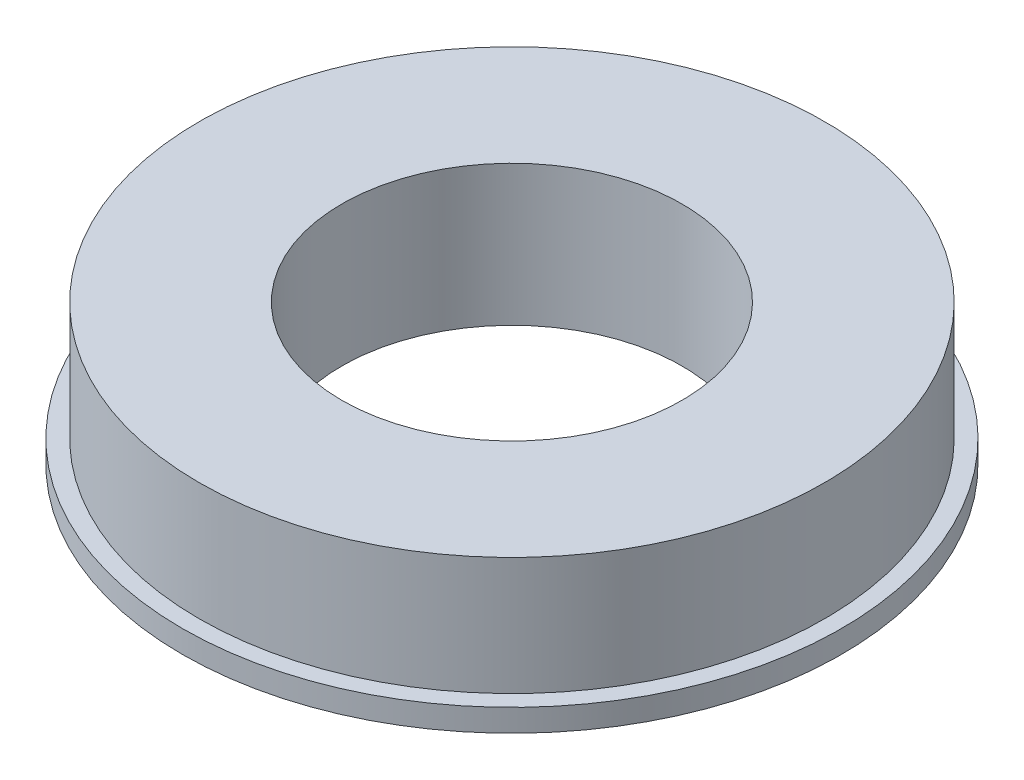
ISO-10303-21;
HEADER;
FILE_DESCRIPTION(('STEP AP214'),'2;1');
FILE_NAME('part.step','',(''),(''),'','','');
FILE_SCHEMA(('AUTOMOTIVE_DESIGN { 1 0 10303 214 1 1 1 1 }'));
ENDSEC;
DATA;
#1=APPLICATION_CONTEXT('core data for automotive mechanical design processes');
#2=APPLICATION_PROTOCOL_DEFINITION('international standard','automotive_design',2000,#1);
#3=PRODUCT_CONTEXT('',#1,'mechanical');
#4=PRODUCT('Part','Part','',(#3));
#5=PRODUCT_RELATED_PRODUCT_CATEGORY('part','',(#4));
#6=PRODUCT_DEFINITION_FORMATION('','',#4);
#7=PRODUCT_DEFINITION_CONTEXT('part definition',#1,'design');
#8=PRODUCT_DEFINITION('design','',#6,#7);
#9=PRODUCT_DEFINITION_SHAPE('','',#8);
#10=(LENGTH_UNIT() NAMED_UNIT(*) SI_UNIT(.MILLI.,.METRE.));
#11=(NAMED_UNIT(*) PLANE_ANGLE_UNIT() SI_UNIT($,.RADIAN.));
#12=(NAMED_UNIT(*) SI_UNIT($,.STERADIAN.) SOLID_ANGLE_UNIT());
#13=UNCERTAINTY_MEASURE_WITH_UNIT(LENGTH_MEASURE(1.E-05),#10,'distance_accuracy_value','');
#14=(GEOMETRIC_REPRESENTATION_CONTEXT(3) GLOBAL_UNCERTAINTY_ASSIGNED_CONTEXT((#13)) GLOBAL_UNIT_ASSIGNED_CONTEXT((#10,
#11,#12)) REPRESENTATION_CONTEXT('',''));
#15=CARTESIAN_POINT('',(0.,0.,0.));
#16=DIRECTION('',(0.,0.,1.));
#17=DIRECTION('',(1.,0.,0.));
#18=AXIS2_PLACEMENT_3D('',#15,#16,#17);
#19=CARTESIAN_POINT('',(0.,12.5,0.));
#20=DIRECTION('',(0.,1.,0.));
#21=DIRECTION('',(0.,0.,1.));
#22=AXIS2_PLACEMENT_3D('',#19,#20,#21);
#23=PLANE('',#22);
#24=CARTESIAN_POINT('',(0.,12.5,0.));
#25=DIRECTION('',(0.,1.,0.));
#26=DIRECTION('',(0.,0.,1.));
#27=AXIS2_PLACEMENT_3D('',#24,#25,#26);
#28=CIRCLE('',#27,27.85);
#29=CARTESIAN_POINT('',(0.,12.5,27.85));
#30=VERTEX_POINT('',#29);
#31=EDGE_CURVE('E10',#30,#30,#28,.T.);
#32=ORIENTED_EDGE('',*,*,#31,.T.);
#33=EDGE_LOOP('',(#32));
#34=FACE_BOUND('',#33,.T.);
#35=CARTESIAN_POINT('',(0.,12.5,0.));
#36=DIRECTION('',(0.,1.,0.));
#37=DIRECTION('',(0.,0.,1.));
#38=AXIS2_PLACEMENT_3D('',#35,#36,#37);
#39=CIRCLE('',#38,15.15);
#40=CARTESIAN_POINT('',(0.,12.5,15.15));
#41=VERTEX_POINT('',#40);
#42=EDGE_CURVE('E38',#41,#41,#39,.T.);
#43=ORIENTED_EDGE('',*,*,#42,.F.);
#44=EDGE_LOOP('',(#43));
#45=FACE_BOUND('',#44,.T.);
#46=ADVANCED_FACE('F31',(#34,#45),#23,.T.);
#47=CARTESIAN_POINT('',(0.,0.,0.));
#48=DIRECTION('',(0.,1.,0.));
#49=DIRECTION('',(0.,0.,1.));
#50=AXIS2_PLACEMENT_3D('',#47,#48,#49);
#51=PLANE('',#50);
#52=CARTESIAN_POINT('',(0.,0.,0.));
#53=DIRECTION('',(0.,1.,0.));
#54=DIRECTION('',(0.,0.,1.));
#55=AXIS2_PLACEMENT_3D('',#52,#53,#54);
#56=CIRCLE('',#55,15.15);
#57=CARTESIAN_POINT('',(0.,0.,15.15));
#58=VERTEX_POINT('',#57);
#59=EDGE_CURVE('E42',#58,#58,#56,.T.);
#60=ORIENTED_EDGE('',*,*,#59,.T.);
#61=EDGE_LOOP('',(#60));
#62=FACE_BOUND('',#61,.T.);
#63=CARTESIAN_POINT('',(0.,0.,0.));
#64=DIRECTION('',(0.,1.,0.));
#65=DIRECTION('',(0.,0.,1.));
#66=AXIS2_PLACEMENT_3D('',#63,#64,#65);
#67=CIRCLE('',#66,29.35);
#68=CARTESIAN_POINT('',(0.,0.,29.35));
#69=VERTEX_POINT('',#68);
#70=EDGE_CURVE('E49',#69,#69,#67,.T.);
#71=ORIENTED_EDGE('',*,*,#70,.F.);
#72=EDGE_LOOP('',(#71));
#73=FACE_BOUND('',#72,.T.);
#74=ADVANCED_FACE('F74',(#62,#73),#51,.F.);
#75=CARTESIAN_POINT('',(0.,12.5,0.));
#76=DIRECTION('',(0.,-1.,0.));
#77=DIRECTION('',(0.,0.,-1.));
#78=AXIS2_PLACEMENT_3D('',#75,#76,#77);
#79=CYLINDRICAL_SURFACE('',#78,27.85);
#80=CARTESIAN_POINT('',(0.,2.,0.));
#81=DIRECTION('',(0.,1.,0.));
#82=DIRECTION('',(0.,0.,1.));
#83=AXIS2_PLACEMENT_3D('',#80,#81,#82);
#84=CIRCLE('',#83,27.85);
#85=CARTESIAN_POINT('',(0.,2.,27.85));
#86=VERTEX_POINT('',#85);
#87=EDGE_CURVE('E52',#86,#86,#84,.T.);
#88=ORIENTED_EDGE('',*,*,#87,.T.);
#89=EDGE_LOOP('',(#88));
#90=FACE_BOUND('',#89,.T.);
#91=ORIENTED_EDGE('',*,*,#31,.F.);
#92=EDGE_LOOP('',(#91));
#93=FACE_BOUND('',#92,.T.);
#94=ADVANCED_FACE('F33',(#90,#93),#79,.T.);
#95=CARTESIAN_POINT('',(0.,12.5,0.));
#96=DIRECTION('',(0.,-1.,0.));
#97=DIRECTION('',(0.,0.,-1.));
#98=AXIS2_PLACEMENT_3D('',#95,#96,#97);
#99=CYLINDRICAL_SURFACE('',#98,15.15);
#100=ORIENTED_EDGE('',*,*,#42,.T.);
#101=EDGE_LOOP('',(#100));
#102=FACE_BOUND('',#101,.T.);
#103=ORIENTED_EDGE('',*,*,#59,.F.);
#104=EDGE_LOOP('',(#103));
#105=FACE_BOUND('',#104,.T.);
#106=ADVANCED_FACE('F63',(#102,#105),#99,.F.);
#107=CARTESIAN_POINT('',(0.,2.,0.));
#108=DIRECTION('',(0.,1.,0.));
#109=DIRECTION('',(0.,0.,1.));
#110=AXIS2_PLACEMENT_3D('',#107,#108,#109);
#111=PLANE('',#110);
#112=CARTESIAN_POINT('',(0.,2.,0.));
#113=DIRECTION('',(0.,1.,0.));
#114=DIRECTION('',(0.,0.,1.));
#115=AXIS2_PLACEMENT_3D('',#112,#113,#114);
#116=CIRCLE('',#115,29.35);
#117=CARTESIAN_POINT('',(0.,2.,29.35));
#118=VERTEX_POINT('',#117);
#119=EDGE_CURVE('E47',#118,#118,#116,.T.);
#120=ORIENTED_EDGE('',*,*,#119,.T.);
#121=EDGE_LOOP('',(#120));
#122=FACE_BOUND('',#121,.T.);
#123=ORIENTED_EDGE('',*,*,#87,.F.);
#124=EDGE_LOOP('',(#123));
#125=FACE_BOUND('',#124,.T.);
#126=ADVANCED_FACE('F60',(#122,#125),#111,.T.);
#127=CARTESIAN_POINT('',(0.,2.,0.));
#128=DIRECTION('',(0.,-1.,0.));
#129=DIRECTION('',(0.,0.,-1.));
#130=AXIS2_PLACEMENT_3D('',#127,#128,#129);
#131=CYLINDRICAL_SURFACE('',#130,29.35);
#132=ORIENTED_EDGE('',*,*,#119,.F.);
#133=EDGE_LOOP('',(#132));
#134=FACE_BOUND('',#133,.T.);
#135=ORIENTED_EDGE('',*,*,#70,.T.);
#136=EDGE_LOOP('',(#135));
#137=FACE_BOUND('',#136,.T.);
#138=ADVANCED_FACE('F62',(#134,#137),#131,.T.);
#139=CLOSED_SHELL('',(#46,#74,#94,#106,#126,#138));
#140=MANIFOLD_SOLID_BREP('B2',#139);
#141=ADVANCED_BREP_SHAPE_REPRESENTATION('',(#18,#140),#14);
#142=SHAPE_DEFINITION_REPRESENTATION(#9,#141);
ENDSEC;
END-ISO-10303-21;
